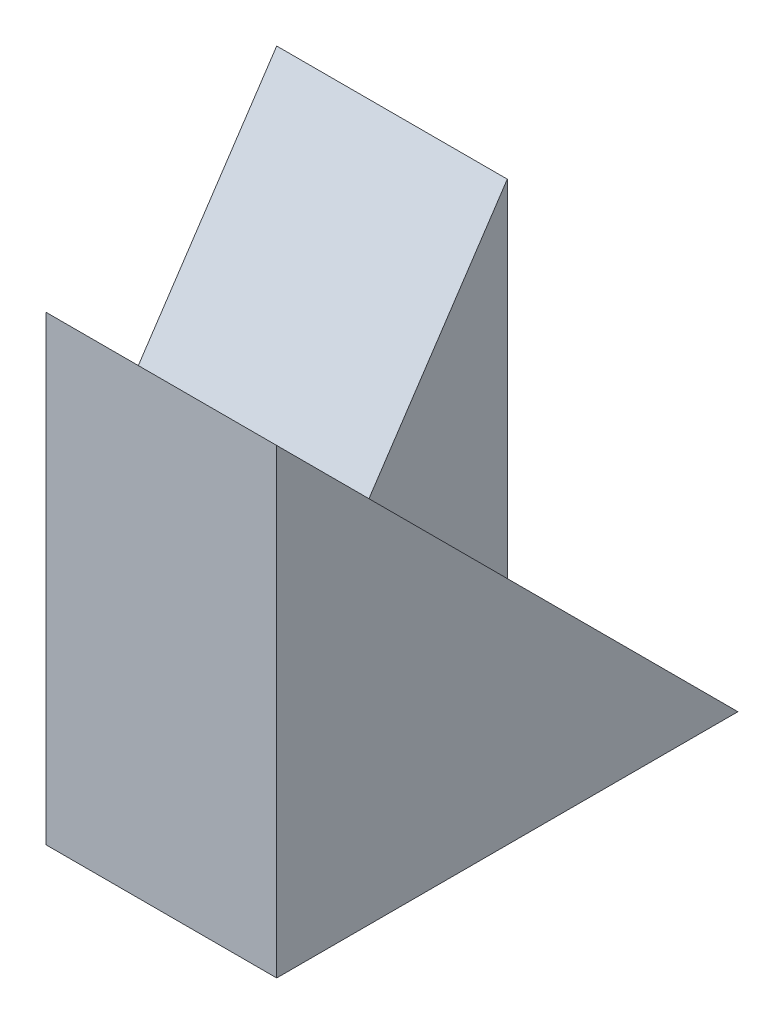
ISO-10303-21;
HEADER;
FILE_DESCRIPTION(('STEP AP214'),'2;1');
FILE_NAME('part.step','',(''),(''),'','','');
FILE_SCHEMA(('AUTOMOTIVE_DESIGN { 1 0 10303 214 1 1 1 1 }'));
ENDSEC;
DATA;
#1=APPLICATION_CONTEXT('core data for automotive mechanical design processes');
#2=APPLICATION_PROTOCOL_DEFINITION('international standard','automotive_design',2000,#1);
#3=PRODUCT_CONTEXT('',#1,'mechanical');
#4=PRODUCT('Part','Part','',(#3));
#5=PRODUCT_RELATED_PRODUCT_CATEGORY('part','',(#4));
#6=PRODUCT_DEFINITION_FORMATION('','',#4);
#7=PRODUCT_DEFINITION_CONTEXT('part definition',#1,'design');
#8=PRODUCT_DEFINITION('design','',#6,#7);
#9=PRODUCT_DEFINITION_SHAPE('','',#8);
#10=(LENGTH_UNIT() NAMED_UNIT(*) SI_UNIT(.MILLI.,.METRE.));
#11=(NAMED_UNIT(*) PLANE_ANGLE_UNIT() SI_UNIT($,.RADIAN.));
#12=(NAMED_UNIT(*) SI_UNIT($,.STERADIAN.) SOLID_ANGLE_UNIT());
#13=UNCERTAINTY_MEASURE_WITH_UNIT(LENGTH_MEASURE(1.E-05),#10,'distance_accuracy_value','');
#14=(GEOMETRIC_REPRESENTATION_CONTEXT(3) GLOBAL_UNCERTAINTY_ASSIGNED_CONTEXT((#13)) GLOBAL_UNIT_ASSIGNED_CONTEXT((#10,
#11,#12)) REPRESENTATION_CONTEXT('',''));
#15=CARTESIAN_POINT('',(0.,0.,0.));
#16=DIRECTION('',(0.,0.,1.));
#17=DIRECTION('',(1.,0.,0.));
#18=AXIS2_PLACEMENT_3D('',#15,#16,#17);
#19=CARTESIAN_POINT('',(2.,0.,0.));
#20=DIRECTION('',(0.,0.,-1.));
#21=DIRECTION('',(-1.,0.,0.));
#22=AXIS2_PLACEMENT_3D('',#19,#20,#21);
#23=PLANE('',#22);
#24=DIRECTION('',(0.,-1.,0.));
#25=VECTOR('',#24,1.);
#26=CARTESIAN_POINT('',(0.,0.,0.));
#27=LINE('',#26,#25);
#28=CARTESIAN_POINT('',(0.,4.,0.));
#29=VERTEX_POINT('',#28);
#30=CARTESIAN_POINT('',(0.,0.,0.));
#31=VERTEX_POINT('',#30);
#32=EDGE_CURVE('E111',#29,#31,#27,.T.);
#33=ORIENTED_EDGE('',*,*,#32,.T.);
#34=DIRECTION('',(-1.,0.,0.));
#35=VECTOR('',#34,1.);
#36=CARTESIAN_POINT('',(2.,0.,0.));
#37=LINE('',#36,#35);
#38=CARTESIAN_POINT('',(2.,0.,0.));
#39=VERTEX_POINT('',#38);
#40=EDGE_CURVE('E11',#39,#31,#37,.T.);
#41=ORIENTED_EDGE('',*,*,#40,.F.);
#42=DIRECTION('',(0.,-1.,0.));
#43=VECTOR('',#42,1.);
#44=CARTESIAN_POINT('',(2.,0.,0.));
#45=LINE('',#44,#43);
#46=CARTESIAN_POINT('',(2.,4.,0.));
#47=VERTEX_POINT('',#46);
#48=EDGE_CURVE('E129',#47,#39,#45,.T.);
#49=ORIENTED_EDGE('',*,*,#48,.F.);
#50=DIRECTION('',(-1.,0.,0.));
#51=VECTOR('',#50,1.);
#52=CARTESIAN_POINT('',(2.,4.,0.));
#53=LINE('',#52,#51);
#54=EDGE_CURVE('E133',#47,#29,#53,.T.);
#55=ORIENTED_EDGE('',*,*,#54,.T.);
#56=EDGE_LOOP('',(#33,#41,#49,#55));
#57=FACE_BOUND('',#56,.T.);
#58=ADVANCED_FACE('F33',(#57),#23,.F.);
#59=CARTESIAN_POINT('',(2.,0.,0.));
#60=DIRECTION('',(0.,1.,0.));
#61=DIRECTION('',(0.,0.,1.));
#62=AXIS2_PLACEMENT_3D('',#59,#60,#61);
#63=PLANE('',#62);
#64=DIRECTION('',(0.,0.,-1.));
#65=VECTOR('',#64,1.);
#66=CARTESIAN_POINT('',(0.,0.,0.));
#67=LINE('',#66,#65);
#68=CARTESIAN_POINT('',(0.,0.,-2.));
#69=VERTEX_POINT('',#68);
#70=EDGE_CURVE('E131',#31,#69,#67,.T.);
#71=ORIENTED_EDGE('',*,*,#70,.T.);
#72=DIRECTION('',(1.,0.,0.));
#73=VECTOR('',#72,1.);
#74=CARTESIAN_POINT('',(-2.,0.,-2.));
#75=LINE('',#74,#73);
#76=CARTESIAN_POINT('',(-2.,0.,-2.));
#77=VERTEX_POINT('',#76);
#78=EDGE_CURVE('E108',#77,#69,#75,.T.);
#79=ORIENTED_EDGE('',*,*,#78,.F.);
#80=DIRECTION('',(0.,0.,1.));
#81=VECTOR('',#80,1.);
#82=CARTESIAN_POINT('',(-2.,0.,-4.));
#83=LINE('',#82,#81);
#84=CARTESIAN_POINT('',(-2.,0.,-4.));
#85=VERTEX_POINT('',#84);
#86=EDGE_CURVE('E109',#85,#77,#83,.T.);
#87=ORIENTED_EDGE('',*,*,#86,.F.);
#88=DIRECTION('',(-1.,0.,0.));
#89=VECTOR('',#88,1.);
#90=CARTESIAN_POINT('',(2.,0.,-4.));
#91=LINE('',#90,#89);
#92=CARTESIAN_POINT('',(0.,0.,-4.));
#93=VERTEX_POINT('',#92);
#94=EDGE_CURVE('E141',#93,#85,#91,.T.);
#95=ORIENTED_EDGE('',*,*,#94,.F.);
#96=CARTESIAN_POINT('',(2.,0.,-4.));
#97=VERTEX_POINT('',#96);
#98=EDGE_CURVE('E43',#97,#93,#91,.T.);
#99=ORIENTED_EDGE('',*,*,#98,.F.);
#100=DIRECTION('',(0.,0.,-1.));
#101=VECTOR('',#100,1.);
#102=CARTESIAN_POINT('',(2.,0.,0.));
#103=LINE('',#102,#101);
#104=EDGE_CURVE('E49',#39,#97,#103,.T.);
#105=ORIENTED_EDGE('',*,*,#104,.F.);
#106=ORIENTED_EDGE('',*,*,#40,.T.);
#107=EDGE_LOOP('',(#71,#79,#87,#95,#99,#105,#106));
#108=FACE_BOUND('',#107,.T.);
#109=ADVANCED_FACE('F153',(#108),#63,.F.);
#110=CARTESIAN_POINT('',(2.,0.,-4.));
#111=DIRECTION('',(0.,0.,1.));
#112=DIRECTION('',(1.,0.,0.));
#113=AXIS2_PLACEMENT_3D('',#110,#111,#112);
#114=PLANE('',#113);
#115=DIRECTION('',(1.,0.,0.));
#116=VECTOR('',#115,1.);
#117=CARTESIAN_POINT('',(-2.,3.,-4.));
#118=LINE('',#117,#116);
#119=CARTESIAN_POINT('',(-2.,3.,-4.));
#120=VERTEX_POINT('',#119);
#121=CARTESIAN_POINT('',(0.,3.,-4.));
#122=VERTEX_POINT('',#121);
#123=EDGE_CURVE('E89',#120,#122,#118,.T.);
#124=ORIENTED_EDGE('',*,*,#123,.T.);
#125=DIRECTION('',(0.,1.,0.));
#126=VECTOR('',#125,1.);
#127=CARTESIAN_POINT('',(0.,0.,-4.));
#128=LINE('',#127,#126);
#129=EDGE_CURVE('E96',#93,#122,#128,.T.);
#130=ORIENTED_EDGE('',*,*,#129,.F.);
#131=ORIENTED_EDGE('',*,*,#94,.T.);
#132=DIRECTION('',(0.,-1.,0.));
#133=VECTOR('',#132,1.);
#134=CARTESIAN_POINT('',(-2.,0.,-4.));
#135=LINE('',#134,#133);
#136=EDGE_CURVE('E102',#120,#85,#135,.T.);
#137=ORIENTED_EDGE('',*,*,#136,.F.);
#138=EDGE_LOOP('',(#124,#130,#131,#137));
#139=FACE_BOUND('',#138,.T.);
#140=ADVANCED_FACE('F106',(#139),#114,.F.);
#141=CARTESIAN_POINT('',(2.,0.,0.));
#142=DIRECTION('',(-1.,0.,0.));
#143=DIRECTION('',(0.,0.,1.));
#144=AXIS2_PLACEMENT_3D('',#141,#142,#143);
#145=PLANE('',#144);
#146=ORIENTED_EDGE('',*,*,#104,.T.);
#147=DIRECTION('',(0.,-0.707106781186548,-0.707106781186548));
#148=VECTOR('',#147,1.);
#149=CARTESIAN_POINT('',(2.,4.,0.));
#150=LINE('',#149,#148);
#151=EDGE_CURVE('E94',#47,#97,#150,.T.);
#152=ORIENTED_EDGE('',*,*,#151,.F.);
#153=ORIENTED_EDGE('',*,*,#48,.T.);
#154=EDGE_LOOP('',(#146,#152,#153));
#155=FACE_BOUND('',#154,.T.);
#156=ADVANCED_FACE('F159',(#155),#145,.F.);
#157=CARTESIAN_POINT('',(0.,0.,0.));
#158=DIRECTION('',(-1.,0.,0.));
#159=DIRECTION('',(0.,0.,1.));
#160=AXIS2_PLACEMENT_3D('',#157,#158,#159);
#161=PLANE('',#160);
#162=DIRECTION('',(0.,-0.707106781186548,-0.707106781186548));
#163=VECTOR('',#162,1.);
#164=CARTESIAN_POINT('',(0.,4.,0.));
#165=LINE('',#164,#163);
#166=CARTESIAN_POINT('',(0.,1.2,-2.8));
#167=VERTEX_POINT('',#166);
#168=EDGE_CURVE('E103',#29,#167,#165,.T.);
#169=ORIENTED_EDGE('',*,*,#168,.T.);
#170=DIRECTION('',(0.,-0.832050294337844,0.554700196225229));
#171=VECTOR('',#170,1.);
#172=CARTESIAN_POINT('',(0.,0.,-2.));
#173=LINE('',#172,#171);
#174=EDGE_CURVE('E36',#167,#69,#173,.T.);
#175=ORIENTED_EDGE('',*,*,#174,.T.);
#176=ORIENTED_EDGE('',*,*,#70,.F.);
#177=ORIENTED_EDGE('',*,*,#32,.F.);
#178=EDGE_LOOP('',(#169,#175,#176,#177));
#179=FACE_BOUND('',#178,.T.);
#180=ADVANCED_FACE('F151',(#179),#161,.T.);
#181=CARTESIAN_POINT('',(-2.,0.,0.));
#182=DIRECTION('',(1.,0.,0.));
#183=DIRECTION('',(0.,0.,-1.));
#184=AXIS2_PLACEMENT_3D('',#181,#182,#183);
#185=PLANE('',#184);
#186=ORIENTED_EDGE('',*,*,#86,.T.);
#187=DIRECTION('',(0.,-0.832050294337844,0.554700196225229));
#188=VECTOR('',#187,1.);
#189=CARTESIAN_POINT('',(-2.,0.,-2.));
#190=LINE('',#189,#188);
#191=EDGE_CURVE('E121',#120,#77,#190,.T.);
#192=ORIENTED_EDGE('',*,*,#191,.F.);
#193=ORIENTED_EDGE('',*,*,#136,.T.);
#194=EDGE_LOOP('',(#186,#192,#193));
#195=FACE_BOUND('',#194,.T.);
#196=ADVANCED_FACE('F165',(#195),#185,.F.);
#197=CARTESIAN_POINT('',(0.,0.,0.));
#198=DIRECTION('',(-1.,0.,0.));
#199=DIRECTION('',(0.,0.,1.));
#200=AXIS2_PLACEMENT_3D('',#197,#198,#199);
#201=PLANE('',#200);
#202=ORIENTED_EDGE('',*,*,#129,.T.);
#203=EDGE_CURVE('E85',#122,#167,#173,.T.);
#204=ORIENTED_EDGE('',*,*,#203,.T.);
#205=EDGE_CURVE('E98',#167,#93,#165,.T.);
#206=ORIENTED_EDGE('',*,*,#205,.T.);
#207=EDGE_LOOP('',(#202,#204,#206));
#208=FACE_BOUND('',#207,.T.);
#209=ADVANCED_FACE('F97',(#208),#201,.F.);
#210=CARTESIAN_POINT('',(0.,4.,0.));
#211=DIRECTION('',(0.,-0.707106781186547,0.707106781186547));
#212=DIRECTION('',(0.,-0.707106781186548,-0.707106781186548));
#213=AXIS2_PLACEMENT_3D('',#210,#211,#212);
#214=PLANE('',#213);
#215=ORIENTED_EDGE('',*,*,#151,.T.);
#216=ORIENTED_EDGE('',*,*,#98,.T.);
#217=ORIENTED_EDGE('',*,*,#205,.F.);
#218=ORIENTED_EDGE('',*,*,#168,.F.);
#219=ORIENTED_EDGE('',*,*,#54,.F.);
#220=EDGE_LOOP('',(#215,#216,#217,#218,#219));
#221=FACE_BOUND('',#220,.T.);
#222=ADVANCED_FACE('F172',(#221),#214,.F.);
#223=CARTESIAN_POINT('',(0.,0.,-2.));
#224=DIRECTION('',(0.,-0.554700196225229,-0.832050294337844));
#225=DIRECTION('',(0.,0.832050294337844,-0.554700196225229));
#226=AXIS2_PLACEMENT_3D('',#223,#224,#225);
#227=PLANE('',#226);
#228=ORIENTED_EDGE('',*,*,#191,.T.);
#229=ORIENTED_EDGE('',*,*,#78,.T.);
#230=ORIENTED_EDGE('',*,*,#174,.F.);
#231=ORIENTED_EDGE('',*,*,#203,.F.);
#232=ORIENTED_EDGE('',*,*,#123,.F.);
#233=EDGE_LOOP('',(#228,#229,#230,#231,#232));
#234=FACE_BOUND('',#233,.T.);
#235=ADVANCED_FACE('F87',(#234),#227,.F.);
#236=CLOSED_SHELL('',(#58,#109,#140,#156,#180,#196,#209,#222,#235));
#237=MANIFOLD_SOLID_BREP('B2',#236);
#238=ADVANCED_BREP_SHAPE_REPRESENTATION('',(#18,#237),#14);
#239=SHAPE_DEFINITION_REPRESENTATION(#9,#238);
ENDSEC;
END-ISO-10303-21;
